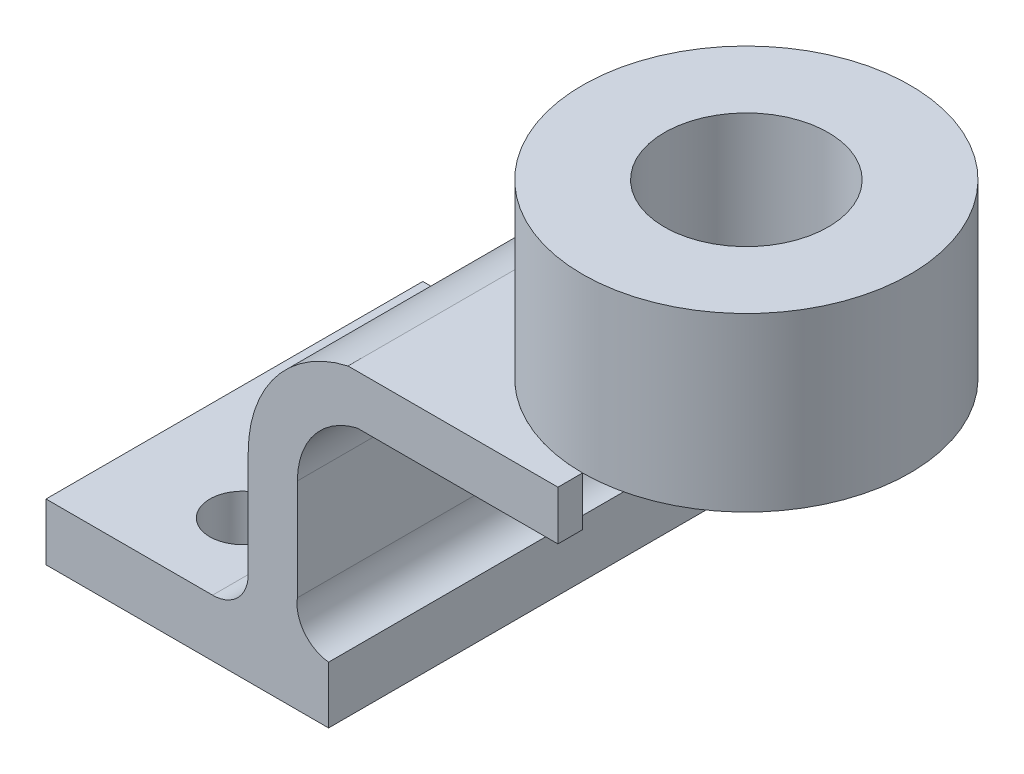
ISO-10303-21;
HEADER;
FILE_DESCRIPTION(('STEP AP214'),'2;1');
FILE_NAME('part.step','',(''),(''),'','','');
FILE_SCHEMA(('AUTOMOTIVE_DESIGN { 1 0 10303 214 1 1 1 1 }'));
ENDSEC;
DATA;
#1=APPLICATION_CONTEXT('core data for automotive mechanical design processes');
#2=APPLICATION_PROTOCOL_DEFINITION('international standard','automotive_design',2000,#1);
#3=PRODUCT_CONTEXT('',#1,'mechanical');
#4=PRODUCT('Part','Part','',(#3));
#5=PRODUCT_RELATED_PRODUCT_CATEGORY('part','',(#4));
#6=PRODUCT_DEFINITION_FORMATION('','',#4);
#7=PRODUCT_DEFINITION_CONTEXT('part definition',#1,'design');
#8=PRODUCT_DEFINITION('design','',#6,#7);
#9=PRODUCT_DEFINITION_SHAPE('','',#8);
#10=(LENGTH_UNIT() NAMED_UNIT(*) SI_UNIT(.MILLI.,.METRE.));
#11=(NAMED_UNIT(*) PLANE_ANGLE_UNIT() SI_UNIT($,.RADIAN.));
#12=(NAMED_UNIT(*) SI_UNIT($,.STERADIAN.) SOLID_ANGLE_UNIT());
#13=UNCERTAINTY_MEASURE_WITH_UNIT(LENGTH_MEASURE(1.E-05),#10,'distance_accuracy_value','');
#14=(GEOMETRIC_REPRESENTATION_CONTEXT(3) GLOBAL_UNCERTAINTY_ASSIGNED_CONTEXT((#13)) GLOBAL_UNIT_ASSIGNED_CONTEXT((#10,
#11,#12)) REPRESENTATION_CONTEXT('',''));
#15=CARTESIAN_POINT('',(0.,0.,0.));
#16=DIRECTION('',(0.,0.,1.));
#17=DIRECTION('',(1.,0.,0.));
#18=AXIS2_PLACEMENT_3D('',#15,#16,#17);
#19=CARTESIAN_POINT('',(-9.49541284403671,53.4425903555686,-46.));
#20=DIRECTION('',(0.,1.,0.));
#21=DIRECTION('',(0.,0.,1.));
#22=AXIS2_PLACEMENT_3D('',#19,#20,#21);
#23=PLANE('',#22);
#24=CARTESIAN_POINT('',(41.7568770301251,53.4425903555686,0.));
#25=DIRECTION('',(0.,1.,0.));
#26=DIRECTION('',(0.,0.,1.));
#27=AXIS2_PLACEMENT_3D('',#24,#25,#26);
#28=CIRCLE('',#27,40.);
#29=CARTESIAN_POINT('',(41.7568770301251,53.4425903555686,40.));
#30=VERTEX_POINT('',#29);
#31=CARTESIAN_POINT('',(41.7568770301251,53.4425903555686,-40.));
#32=VERTEX_POINT('',#31);
#33=EDGE_CURVE('E266',#30,#32,#28,.F.);
#34=ORIENTED_EDGE('',*,*,#33,.T.);
#35=DIRECTION('',(0.,0.,-1.));
#36=VECTOR('',#35,1.);
#37=CARTESIAN_POINT('',(41.7568770301251,53.4425903555686,0.));
#38=LINE('',#37,#36);
#39=CARTESIAN_POINT('',(41.7568770301251,53.4425903555686,-46.));
#40=VERTEX_POINT('',#39);
#41=EDGE_CURVE('E202',#32,#40,#38,.T.);
#42=ORIENTED_EDGE('',*,*,#41,.T.);
#43=DIRECTION('',(-1.,0.,0.));
#44=VECTOR('',#43,1.);
#45=CARTESIAN_POINT('',(-9.49541284403671,53.4425903555686,-46.));
#46=LINE('',#45,#44);
#47=CARTESIAN_POINT('',(-9.49541284403671,53.4425903555686,-46.));
#48=VERTEX_POINT('',#47);
#49=EDGE_CURVE('E199',#40,#48,#46,.T.);
#50=ORIENTED_EDGE('',*,*,#49,.T.);
#51=DIRECTION('',(0.,0.,1.));
#52=VECTOR('',#51,1.);
#53=CARTESIAN_POINT('',(-9.49541284403671,53.4425903555686,-46.));
#54=LINE('',#53,#52);
#55=CARTESIAN_POINT('',(-9.49541284403671,53.4425903555686,46.));
#56=VERTEX_POINT('',#55);
#57=EDGE_CURVE('E201',#48,#56,#54,.T.);
#58=ORIENTED_EDGE('',*,*,#57,.T.);
#59=DIRECTION('',(-1.,0.,0.));
#60=VECTOR('',#59,1.);
#61=CARTESIAN_POINT('',(-9.49541284403671,53.4425903555686,46.));
#62=LINE('',#61,#60);
#63=CARTESIAN_POINT('',(41.7568770301251,53.4425903555686,46.));
#64=VERTEX_POINT('',#63);
#65=EDGE_CURVE('E236',#64,#56,#62,.T.);
#66=ORIENTED_EDGE('',*,*,#65,.F.);
#67=DIRECTION('',(0.,0.,1.));
#68=VECTOR('',#67,1.);
#69=CARTESIAN_POINT('',(41.7568770301251,53.4425903555686,0.));
#70=LINE('',#69,#68);
#71=EDGE_CURVE('E12',#30,#64,#70,.T.);
#72=ORIENTED_EDGE('',*,*,#71,.F.);
#73=EDGE_LOOP('',(#34,#42,#50,#58,#66,#72));
#74=FACE_BOUND('',#73,.T.);
#75=ADVANCED_FACE('F45',(#74),#23,.T.);
#76=CARTESIAN_POINT('',(-7.27806145642214,41.4425656485176,-46.));
#77=DIRECTION('',(0.,-1.,0.));
#78=DIRECTION('',(0.,0.,-1.));
#79=AXIS2_PLACEMENT_3D('',#76,#77,#78);
#80=PLANE('',#79);
#81=DIRECTION('',(1.,0.,0.));
#82=VECTOR('',#81,1.);
#83=CARTESIAN_POINT('',(-7.27806145642214,41.4425656485176,-46.));
#84=LINE('',#83,#82);
#85=CARTESIAN_POINT('',(-7.27806145642214,41.4425656485176,-46.));
#86=VERTEX_POINT('',#85);
#87=CARTESIAN_POINT('',(41.7568770301251,41.4425656485176,-46.));
#88=VERTEX_POINT('',#87);
#89=EDGE_CURVE('E203',#86,#88,#84,.T.);
#90=ORIENTED_EDGE('',*,*,#89,.T.);
#91=DIRECTION('',(0.,0.,1.));
#92=VECTOR('',#91,1.);
#93=CARTESIAN_POINT('',(41.7568770301251,41.4425656485176,-46.));
#94=LINE('',#93,#92);
#95=CARTESIAN_POINT('',(41.7568770301251,41.4425656485176,-40.));
#96=VERTEX_POINT('',#95);
#97=EDGE_CURVE('E206',#88,#96,#94,.T.);
#98=ORIENTED_EDGE('',*,*,#97,.T.);
#99=CARTESIAN_POINT('',(41.7568770301251,41.4425656485176,0.));
#100=DIRECTION('',(0.,-1.,0.));
#101=DIRECTION('',(0.,0.,-1.));
#102=AXIS2_PLACEMENT_3D('',#99,#100,#101);
#103=CIRCLE('',#102,40.);
#104=CARTESIAN_POINT('',(41.7568770301251,41.4425656485176,40.));
#105=VERTEX_POINT('',#104);
#106=EDGE_CURVE('E86',#105,#96,#103,.T.);
#107=ORIENTED_EDGE('',*,*,#106,.F.);
#108=DIRECTION('',(0.,0.,-1.));
#109=VECTOR('',#108,1.);
#110=CARTESIAN_POINT('',(41.7568770301251,41.4425656485176,-46.));
#111=LINE('',#110,#109);
#112=CARTESIAN_POINT('',(41.7568770301251,41.4425656485176,46.));
#113=VERTEX_POINT('',#112);
#114=EDGE_CURVE('E259',#113,#105,#111,.T.);
#115=ORIENTED_EDGE('',*,*,#114,.F.);
#116=DIRECTION('',(1.,0.,0.));
#117=VECTOR('',#116,1.);
#118=CARTESIAN_POINT('',(-7.27806145642214,41.4425656485176,46.));
#119=LINE('',#118,#117);
#120=CARTESIAN_POINT('',(-7.27806145642214,41.4425656485176,46.));
#121=VERTEX_POINT('',#120);
#122=EDGE_CURVE('E223',#121,#113,#119,.T.);
#123=ORIENTED_EDGE('',*,*,#122,.F.);
#124=DIRECTION('',(0.,0.,1.));
#125=VECTOR('',#124,1.);
#126=CARTESIAN_POINT('',(-7.27806145642214,41.4425656485176,-46.));
#127=LINE('',#126,#125);
#128=EDGE_CURVE('E198',#86,#121,#127,.T.);
#129=ORIENTED_EDGE('',*,*,#128,.F.);
#130=EDGE_LOOP('',(#90,#98,#107,#115,#123,#129));
#131=FACE_BOUND('',#130,.T.);
#132=ADVANCED_FACE('F313',(#131),#80,.T.);
#133=CARTESIAN_POINT('',(-42.5733944954129,-2.85101233313381,-46.));
#134=DIRECTION('',(0.,0.,-1.));
#135=DIRECTION('',(-1.,0.,0.));
#136=AXIS2_PLACEMENT_3D('',#133,#134,#135);
#137=PLANE('',#136);
#138=ORIENTED_EDGE('',*,*,#49,.F.);
#139=DIRECTION('',(0.,1.,0.));
#140=VECTOR('',#139,1.);
#141=CARTESIAN_POINT('',(41.7568770301251,4.44259035556865,-46.));
#142=LINE('',#141,#140);
#143=EDGE_CURVE('E77',#88,#40,#142,.T.);
#144=ORIENTED_EDGE('',*,*,#143,.F.);
#145=ORIENTED_EDGE('',*,*,#89,.F.);
#146=CARTESIAN_POINT('',(-2.84865405143777,22.9472477064222,-46.));
#147=DIRECTION('',(0.,0.,-1.));
#148=DIRECTION('',(-1.,0.,0.));
#149=AXIS2_PLACEMENT_3D('',#146,#147,#148);
#150=CIRCLE('',#149,19.0183184256265);
#151=CARTESIAN_POINT('',(-21.8669724770642,22.9472477064222,-46.));
#152=VERTEX_POINT('',#151);
#153=EDGE_CURVE('E207',#152,#86,#150,.T.);
#154=ORIENTED_EDGE('',*,*,#153,.F.);
#155=DIRECTION('',(0.,1.,0.));
#156=VECTOR('',#155,1.);
#157=CARTESIAN_POINT('',(-21.8669724770642,-1.75425159718645,-46.));
#158=LINE('',#157,#156);
#159=CARTESIAN_POINT('',(-21.8669724770642,-1.75425159718645,-46.));
#160=VERTEX_POINT('',#159);
#161=EDGE_CURVE('E211',#160,#152,#158,.T.);
#162=ORIENTED_EDGE('',*,*,#161,.F.);
#163=CARTESIAN_POINT('',(-13.3869449851293,-3.02550029347313,-46.));
#164=DIRECTION('',(0.,0.,-1.));
#165=DIRECTION('',(-1.,0.,0.));
#166=AXIS2_PLACEMENT_3D('',#163,#164,#165);
#167=CIRCLE('',#166,8.574785100035);
#168=CARTESIAN_POINT('',(-14.2431229698749,-11.5574343514824,-46.));
#169=VERTEX_POINT('',#168);
#170=EDGE_CURVE('E215',#169,#160,#167,.T.);
#171=ORIENTED_EDGE('',*,*,#170,.F.);
#172=DIRECTION('',(0.,1.,0.));
#173=VECTOR('',#172,1.);
#174=CARTESIAN_POINT('',(-14.2431229698749,-25.4793825052162,-46.));
#175=LINE('',#174,#173);
#176=CARTESIAN_POINT('',(-14.2431229698749,-25.4793825052162,-46.));
#177=VERTEX_POINT('',#176);
#178=EDGE_CURVE('E219',#177,#169,#175,.T.);
#179=ORIENTED_EDGE('',*,*,#178,.F.);
#180=DIRECTION('',(1.,0.,0.));
#181=VECTOR('',#180,1.);
#182=CARTESIAN_POINT('',(-83.2431229698749,-25.4793825052162,-46.));
#183=LINE('',#182,#181);
#184=CARTESIAN_POINT('',(-83.2431229698749,-25.4793825052162,-46.));
#185=VERTEX_POINT('',#184);
#186=EDGE_CURVE('E179',#185,#177,#183,.T.);
#187=ORIENTED_EDGE('',*,*,#186,.F.);
#188=DIRECTION('',(0.,-1.,0.));
#189=VECTOR('',#188,1.);
#190=CARTESIAN_POINT('',(-83.2431229698749,-25.4793825052162,-46.));
#191=LINE('',#190,#189);
#192=CARTESIAN_POINT('',(-83.2431229698749,-11.5574343514824,-46.));
#193=VERTEX_POINT('',#192);
#194=EDGE_CURVE('E162',#193,#185,#191,.T.);
#195=ORIENTED_EDGE('',*,*,#194,.F.);
#196=DIRECTION('',(-1.,0.,0.));
#197=VECTOR('',#196,1.);
#198=CARTESIAN_POINT('',(-83.2431229698749,-11.5574343514824,-46.));
#199=LINE('',#198,#197);
#200=CARTESIAN_POINT('',(-42.5733944954129,-11.5574343514824,-46.));
#201=VERTEX_POINT('',#200);
#202=EDGE_CURVE('E169',#201,#193,#199,.T.);
#203=ORIENTED_EDGE('',*,*,#202,.F.);
#204=CARTESIAN_POINT('',(-42.5733944954129,-2.85101233313381,-46.));
#205=DIRECTION('',(0.,0.,-1.));
#206=DIRECTION('',(-1.,0.,0.));
#207=AXIS2_PLACEMENT_3D('',#204,#205,#206);
#208=CIRCLE('',#207,8.70642201834863);
#209=CARTESIAN_POINT('',(-33.8669724770642,-2.85101233313381,-46.));
#210=VERTEX_POINT('',#209);
#211=EDGE_CURVE('E186',#210,#201,#208,.T.);
#212=ORIENTED_EDGE('',*,*,#211,.F.);
#213=DIRECTION('',(0.,-1.,0.));
#214=VECTOR('',#213,1.);
#215=CARTESIAN_POINT('',(-33.8669724770642,-2.85101233313381,-46.));
#216=LINE('',#215,#214);
#217=CARTESIAN_POINT('',(-33.8669724770642,22.947247706422,-46.));
#218=VERTEX_POINT('',#217);
#219=EDGE_CURVE('E191',#218,#210,#216,.T.);
#220=ORIENTED_EDGE('',*,*,#219,.F.);
#221=CARTESIAN_POINT('',(-2.60227573254637,22.947247706422,-46.));
#222=DIRECTION('',(0.,0.,1.));
#223=DIRECTION('',(-1.,0.,0.));
#224=AXIS2_PLACEMENT_3D('',#221,#222,#223);
#225=CIRCLE('',#224,31.2646967445179);
#226=EDGE_CURVE('E195',#48,#218,#225,.T.);
#227=ORIENTED_EDGE('',*,*,#226,.F.);
#228=EDGE_LOOP('',(#138,#144,#145,#154,#162,#171,#179,#187,#195,#203,#212,#220,#227));
#229=FACE_BOUND('',#228,.T.);
#230=ADVANCED_FACE('F175',(#229),#137,.T.);
#231=CARTESIAN_POINT('',(-83.2431229698749,-25.4793825052162,-46.));
#232=DIRECTION('',(-1.,0.,0.));
#233=DIRECTION('',(0.,0.,1.));
#234=AXIS2_PLACEMENT_3D('',#231,#232,#233);
#235=PLANE('',#234);
#236=DIRECTION('',(0.,0.,1.));
#237=VECTOR('',#236,1.);
#238=CARTESIAN_POINT('',(-83.2431229698749,-25.4793825052162,-46.));
#239=LINE('',#238,#237);
#240=CARTESIAN_POINT('',(-83.2431229698749,-25.4793825052162,46.));
#241=VERTEX_POINT('',#240);
#242=EDGE_CURVE('E180',#185,#241,#239,.T.);
#243=ORIENTED_EDGE('',*,*,#242,.T.);
#244=DIRECTION('',(0.,-1.,0.));
#245=VECTOR('',#244,1.);
#246=CARTESIAN_POINT('',(-83.2431229698749,-25.4793825052162,46.));
#247=LINE('',#246,#245);
#248=CARTESIAN_POINT('',(-83.2431229698749,-11.5574343514824,46.));
#249=VERTEX_POINT('',#248);
#250=EDGE_CURVE('E164',#249,#241,#247,.T.);
#251=ORIENTED_EDGE('',*,*,#250,.F.);
#252=DIRECTION('',(0.,0.,1.));
#253=VECTOR('',#252,1.);
#254=CARTESIAN_POINT('',(-83.2431229698749,-11.5574343514824,-46.));
#255=LINE('',#254,#253);
#256=EDGE_CURVE('E159',#193,#249,#255,.T.);
#257=ORIENTED_EDGE('',*,*,#256,.F.);
#258=ORIENTED_EDGE('',*,*,#194,.T.);
#259=EDGE_LOOP('',(#243,#251,#257,#258));
#260=FACE_BOUND('',#259,.T.);
#261=ADVANCED_FACE('F161',(#260),#235,.T.);
#262=CARTESIAN_POINT('',(-83.2431229698749,-11.5574343514824,-46.));
#263=DIRECTION('',(0.,1.,0.));
#264=DIRECTION('',(0.,0.,1.));
#265=AXIS2_PLACEMENT_3D('',#262,#263,#264);
#266=PLANE('',#265);
#267=CARTESIAN_POINT('',(-55.243122969875,-11.5574343514824,26.));
#268=DIRECTION('',(0.,1.,0.));
#269=DIRECTION('',(0.,0.,1.));
#270=AXIS2_PLACEMENT_3D('',#267,#268,#269);
#271=CIRCLE('',#270,8.);
#272=CARTESIAN_POINT('',(-55.243122969875,-11.5574343514824,34.));
#273=VERTEX_POINT('',#272);
#274=EDGE_CURVE('E271',#273,#273,#271,.T.);
#275=ORIENTED_EDGE('',*,*,#274,.F.);
#276=EDGE_LOOP('',(#275));
#277=FACE_BOUND('',#276,.T.);
#278=CARTESIAN_POINT('',(-55.243122969875,-11.5574343514824,-26.));
#279=DIRECTION('',(0.,1.,0.));
#280=DIRECTION('',(0.,0.,1.));
#281=AXIS2_PLACEMENT_3D('',#278,#279,#280);
#282=CIRCLE('',#281,8.);
#283=CARTESIAN_POINT('',(-55.243122969875,-11.5574343514824,-18.));
#284=VERTEX_POINT('',#283);
#285=EDGE_CURVE('E276',#284,#284,#282,.T.);
#286=ORIENTED_EDGE('',*,*,#285,.F.);
#287=EDGE_LOOP('',(#286));
#288=FACE_BOUND('',#287,.T.);
#289=ORIENTED_EDGE('',*,*,#256,.T.);
#290=DIRECTION('',(-1.,0.,0.));
#291=VECTOR('',#290,1.);
#292=CARTESIAN_POINT('',(-83.2431229698749,-11.5574343514824,46.));
#293=LINE('',#292,#291);
#294=CARTESIAN_POINT('',(-42.5733944954129,-11.5574343514824,46.));
#295=VERTEX_POINT('',#294);
#296=EDGE_CURVE('E225',#295,#249,#293,.T.);
#297=ORIENTED_EDGE('',*,*,#296,.F.);
#298=DIRECTION('',(0.,0.,1.));
#299=VECTOR('',#298,1.);
#300=CARTESIAN_POINT('',(-42.5733944954129,-11.5574343514824,-46.));
#301=LINE('',#300,#299);
#302=EDGE_CURVE('E183',#201,#295,#301,.T.);
#303=ORIENTED_EDGE('',*,*,#302,.F.);
#304=ORIENTED_EDGE('',*,*,#202,.T.);
#305=EDGE_LOOP('',(#289,#297,#303,#304));
#306=FACE_BOUND('',#305,.T.);
#307=ADVANCED_FACE('F182',(#277,#288,#306),#266,.T.);
#308=CARTESIAN_POINT('',(-42.5733944954129,-2.85101233313381,-46.));
#309=DIRECTION('',(0.,0.,1.));
#310=DIRECTION('',(1.,0.,0.));
#311=AXIS2_PLACEMENT_3D('',#308,#309,#310);
#312=CYLINDRICAL_SURFACE('',#311,8.70642201834863);
#313=ORIENTED_EDGE('',*,*,#302,.T.);
#314=CARTESIAN_POINT('',(-42.5733944954129,-2.85101233313381,46.));
#315=DIRECTION('',(0.,0.,-1.));
#316=DIRECTION('',(-1.,0.,0.));
#317=AXIS2_PLACEMENT_3D('',#314,#315,#316);
#318=CIRCLE('',#317,8.70642201834863);
#319=CARTESIAN_POINT('',(-33.8669724770642,-2.85101233313381,46.));
#320=VERTEX_POINT('',#319);
#321=EDGE_CURVE('E227',#320,#295,#318,.T.);
#322=ORIENTED_EDGE('',*,*,#321,.F.);
#323=DIRECTION('',(0.,0.,1.));
#324=VECTOR('',#323,1.);
#325=CARTESIAN_POINT('',(-33.8669724770642,-2.85101233313381,-46.));
#326=LINE('',#325,#324);
#327=EDGE_CURVE('E190',#210,#320,#326,.T.);
#328=ORIENTED_EDGE('',*,*,#327,.F.);
#329=ORIENTED_EDGE('',*,*,#211,.T.);
#330=EDGE_LOOP('',(#313,#322,#328,#329));
#331=FACE_BOUND('',#330,.T.);
#332=ADVANCED_FACE('F302',(#331),#312,.F.);
#333=CARTESIAN_POINT('',(-33.8669724770642,-2.85101233313381,-46.));
#334=DIRECTION('',(-1.,0.,0.));
#335=DIRECTION('',(0.,0.,1.));
#336=AXIS2_PLACEMENT_3D('',#333,#334,#335);
#337=PLANE('',#336);
#338=ORIENTED_EDGE('',*,*,#327,.T.);
#339=DIRECTION('',(0.,-1.,0.));
#340=VECTOR('',#339,1.);
#341=CARTESIAN_POINT('',(-33.8669724770642,-2.85101233313381,46.));
#342=LINE('',#341,#340);
#343=CARTESIAN_POINT('',(-33.8669724770642,22.947247706422,46.));
#344=VERTEX_POINT('',#343);
#345=EDGE_CURVE('E230',#344,#320,#342,.T.);
#346=ORIENTED_EDGE('',*,*,#345,.F.);
#347=DIRECTION('',(0.,0.,1.));
#348=VECTOR('',#347,1.);
#349=CARTESIAN_POINT('',(-33.8669724770642,22.947247706422,-46.));
#350=LINE('',#349,#348);
#351=EDGE_CURVE('E194',#218,#344,#350,.T.);
#352=ORIENTED_EDGE('',*,*,#351,.F.);
#353=ORIENTED_EDGE('',*,*,#219,.T.);
#354=EDGE_LOOP('',(#338,#346,#352,#353));
#355=FACE_BOUND('',#354,.T.);
#356=ADVANCED_FACE('F295',(#355),#337,.T.);
#357=CARTESIAN_POINT('',(-2.60227573254637,22.947247706422,-46.));
#358=DIRECTION('',(0.,0.,1.));
#359=DIRECTION('',(1.,0.,0.));
#360=AXIS2_PLACEMENT_3D('',#357,#358,#359);
#361=CYLINDRICAL_SURFACE('',#360,31.2646967445179);
#362=ORIENTED_EDGE('',*,*,#351,.T.);
#363=CARTESIAN_POINT('',(-2.60227573254637,22.947247706422,46.));
#364=DIRECTION('',(0.,0.,1.));
#365=DIRECTION('',(-1.,0.,0.));
#366=AXIS2_PLACEMENT_3D('',#363,#364,#365);
#367=CIRCLE('',#366,31.2646967445179);
#368=EDGE_CURVE('E233',#56,#344,#367,.T.);
#369=ORIENTED_EDGE('',*,*,#368,.F.);
#370=ORIENTED_EDGE('',*,*,#57,.F.);
#371=ORIENTED_EDGE('',*,*,#226,.T.);
#372=EDGE_LOOP('',(#362,#369,#370,#371));
#373=FACE_BOUND('',#372,.T.);
#374=ADVANCED_FACE('F306',(#373),#361,.T.);
#375=CARTESIAN_POINT('',(-2.84865405143777,22.9472477064222,-46.));
#376=DIRECTION('',(0.,0.,1.));
#377=DIRECTION('',(1.,0.,0.));
#378=AXIS2_PLACEMENT_3D('',#375,#376,#377);
#379=CYLINDRICAL_SURFACE('',#378,19.0183184256265);
#380=ORIENTED_EDGE('',*,*,#128,.T.);
#381=CARTESIAN_POINT('',(-2.84865405143777,22.9472477064222,46.));
#382=DIRECTION('',(0.,0.,-1.));
#383=DIRECTION('',(-1.,0.,0.));
#384=AXIS2_PLACEMENT_3D('',#381,#382,#383);
#385=CIRCLE('',#384,19.0183184256265);
#386=CARTESIAN_POINT('',(-21.8669724770642,22.9472477064222,46.));
#387=VERTEX_POINT('',#386);
#388=EDGE_CURVE('E240',#387,#121,#385,.T.);
#389=ORIENTED_EDGE('',*,*,#388,.F.);
#390=DIRECTION('',(0.,0.,1.));
#391=VECTOR('',#390,1.);
#392=CARTESIAN_POINT('',(-21.8669724770642,22.9472477064222,-46.));
#393=LINE('',#392,#391);
#394=EDGE_CURVE('E210',#152,#387,#393,.T.);
#395=ORIENTED_EDGE('',*,*,#394,.F.);
#396=ORIENTED_EDGE('',*,*,#153,.T.);
#397=EDGE_LOOP('',(#380,#389,#395,#396));
#398=FACE_BOUND('',#397,.T.);
#399=ADVANCED_FACE('F317',(#398),#379,.F.);
#400=CARTESIAN_POINT('',(-21.8669724770642,-1.75425159718645,-46.));
#401=DIRECTION('',(1.,0.,0.));
#402=DIRECTION('',(0.,0.,-1.));
#403=AXIS2_PLACEMENT_3D('',#400,#401,#402);
#404=PLANE('',#403);
#405=ORIENTED_EDGE('',*,*,#394,.T.);
#406=DIRECTION('',(0.,1.,0.));
#407=VECTOR('',#406,1.);
#408=CARTESIAN_POINT('',(-21.8669724770642,-1.75425159718645,46.));
#409=LINE('',#408,#407);
#410=CARTESIAN_POINT('',(-21.8669724770642,-1.75425159718645,46.));
#411=VERTEX_POINT('',#410);
#412=EDGE_CURVE('E244',#411,#387,#409,.T.);
#413=ORIENTED_EDGE('',*,*,#412,.F.);
#414=DIRECTION('',(0.,0.,1.));
#415=VECTOR('',#414,1.);
#416=CARTESIAN_POINT('',(-21.8669724770642,-1.75425159718645,-46.));
#417=LINE('',#416,#415);
#418=EDGE_CURVE('E214',#160,#411,#417,.T.);
#419=ORIENTED_EDGE('',*,*,#418,.F.);
#420=ORIENTED_EDGE('',*,*,#161,.T.);
#421=EDGE_LOOP('',(#405,#413,#419,#420));
#422=FACE_BOUND('',#421,.T.);
#423=ADVANCED_FACE('F321',(#422),#404,.T.);
#424=CARTESIAN_POINT('',(-13.3869449851293,-3.02550029347313,-46.));
#425=DIRECTION('',(0.,0.,1.));
#426=DIRECTION('',(1.,0.,0.));
#427=AXIS2_PLACEMENT_3D('',#424,#425,#426);
#428=CYLINDRICAL_SURFACE('',#427,8.574785100035);
#429=ORIENTED_EDGE('',*,*,#418,.T.);
#430=CARTESIAN_POINT('',(-13.3869449851293,-3.02550029347313,46.));
#431=DIRECTION('',(0.,0.,-1.));
#432=DIRECTION('',(-1.,0.,0.));
#433=AXIS2_PLACEMENT_3D('',#430,#431,#432);
#434=CIRCLE('',#433,8.574785100035);
#435=CARTESIAN_POINT('',(-14.2431229698749,-11.5574343514824,46.));
#436=VERTEX_POINT('',#435);
#437=EDGE_CURVE('E247',#436,#411,#434,.T.);
#438=ORIENTED_EDGE('',*,*,#437,.F.);
#439=DIRECTION('',(0.,0.,1.));
#440=VECTOR('',#439,1.);
#441=CARTESIAN_POINT('',(-14.2431229698749,-11.5574343514824,-46.));
#442=LINE('',#441,#440);
#443=EDGE_CURVE('E218',#169,#436,#442,.T.);
#444=ORIENTED_EDGE('',*,*,#443,.F.);
#445=ORIENTED_EDGE('',*,*,#170,.T.);
#446=EDGE_LOOP('',(#429,#438,#444,#445));
#447=FACE_BOUND('',#446,.T.);
#448=ADVANCED_FACE('F325',(#447),#428,.F.);
#449=CARTESIAN_POINT('',(-14.2431229698749,-25.4793825052162,-46.));
#450=DIRECTION('',(1.,0.,0.));
#451=DIRECTION('',(0.,1.,0.));
#452=AXIS2_PLACEMENT_3D('',#449,#450,#451);
#453=PLANE('',#452);
#454=ORIENTED_EDGE('',*,*,#443,.T.);
#455=DIRECTION('',(0.,1.,0.));
#456=VECTOR('',#455,1.);
#457=CARTESIAN_POINT('',(-14.2431229698749,-25.4793825052162,46.));
#458=LINE('',#457,#456);
#459=CARTESIAN_POINT('',(-14.2431229698749,-25.4793825052162,46.));
#460=VERTEX_POINT('',#459);
#461=EDGE_CURVE('E250',#460,#436,#458,.T.);
#462=ORIENTED_EDGE('',*,*,#461,.F.);
#463=DIRECTION('',(0.,0.,1.));
#464=VECTOR('',#463,1.);
#465=CARTESIAN_POINT('',(-14.2431229698749,-25.4793825052162,-46.));
#466=LINE('',#465,#464);
#467=EDGE_CURVE('E222',#177,#460,#466,.T.);
#468=ORIENTED_EDGE('',*,*,#467,.F.);
#469=ORIENTED_EDGE('',*,*,#178,.T.);
#470=EDGE_LOOP('',(#454,#462,#468,#469));
#471=FACE_BOUND('',#470,.T.);
#472=ADVANCED_FACE('F328',(#471),#453,.T.);
#473=CARTESIAN_POINT('',(-83.2431229698749,-25.4793825052162,-46.));
#474=DIRECTION('',(0.,-1.,0.));
#475=DIRECTION('',(0.,0.,-1.));
#476=AXIS2_PLACEMENT_3D('',#473,#474,#475);
#477=PLANE('',#476);
#478=CARTESIAN_POINT('',(-55.243122969875,-25.4793825052162,26.));
#479=DIRECTION('',(0.,-1.,0.));
#480=DIRECTION('',(0.,0.,-1.));
#481=AXIS2_PLACEMENT_3D('',#478,#479,#480);
#482=CIRCLE('',#481,8.);
#483=CARTESIAN_POINT('',(-55.243122969875,-25.4793825052162,18.));
#484=VERTEX_POINT('',#483);
#485=EDGE_CURVE('E49',#484,#484,#482,.T.);
#486=ORIENTED_EDGE('',*,*,#485,.F.);
#487=EDGE_LOOP('',(#486));
#488=FACE_BOUND('',#487,.T.);
#489=CARTESIAN_POINT('',(-55.243122969875,-25.4793825052162,-26.));
#490=DIRECTION('',(0.,-1.,0.));
#491=DIRECTION('',(0.,0.,-1.));
#492=AXIS2_PLACEMENT_3D('',#489,#490,#491);
#493=CIRCLE('',#492,8.);
#494=CARTESIAN_POINT('',(-55.243122969875,-25.4793825052162,-34.));
#495=VERTEX_POINT('',#494);
#496=EDGE_CURVE('E269',#495,#495,#493,.T.);
#497=ORIENTED_EDGE('',*,*,#496,.F.);
#498=EDGE_LOOP('',(#497));
#499=FACE_BOUND('',#498,.T.);
#500=ORIENTED_EDGE('',*,*,#467,.T.);
#501=DIRECTION('',(1.,0.,0.));
#502=VECTOR('',#501,1.);
#503=CARTESIAN_POINT('',(-83.2431229698749,-25.4793825052162,46.));
#504=LINE('',#503,#502);
#505=EDGE_CURVE('E253',#241,#460,#504,.T.);
#506=ORIENTED_EDGE('',*,*,#505,.F.);
#507=ORIENTED_EDGE('',*,*,#242,.F.);
#508=ORIENTED_EDGE('',*,*,#186,.T.);
#509=EDGE_LOOP('',(#500,#506,#507,#508));
#510=FACE_BOUND('',#509,.T.);
#511=ADVANCED_FACE('F331',(#488,#499,#510),#477,.T.);
#512=CARTESIAN_POINT('',(-42.5733944954129,-2.85101233313381,46.));
#513=DIRECTION('',(0.,0.,-1.));
#514=DIRECTION('',(-1.,0.,0.));
#515=AXIS2_PLACEMENT_3D('',#512,#513,#514);
#516=PLANE('',#515);
#517=ORIENTED_EDGE('',*,*,#122,.T.);
#518=DIRECTION('',(0.,1.,0.));
#519=VECTOR('',#518,1.);
#520=CARTESIAN_POINT('',(41.7568770301251,4.44259035556865,46.));
#521=LINE('',#520,#519);
#522=EDGE_CURVE('E62',#113,#64,#521,.T.);
#523=ORIENTED_EDGE('',*,*,#522,.T.);
#524=ORIENTED_EDGE('',*,*,#65,.T.);
#525=ORIENTED_EDGE('',*,*,#368,.T.);
#526=ORIENTED_EDGE('',*,*,#345,.T.);
#527=ORIENTED_EDGE('',*,*,#321,.T.);
#528=ORIENTED_EDGE('',*,*,#296,.T.);
#529=ORIENTED_EDGE('',*,*,#250,.T.);
#530=ORIENTED_EDGE('',*,*,#505,.T.);
#531=ORIENTED_EDGE('',*,*,#461,.T.);
#532=ORIENTED_EDGE('',*,*,#437,.T.);
#533=ORIENTED_EDGE('',*,*,#412,.T.);
#534=ORIENTED_EDGE('',*,*,#388,.T.);
#535=EDGE_LOOP('',(#517,#523,#524,#525,#526,#527,#528,#529,#530,#531,#532,#533,#534));
#536=FACE_BOUND('',#535,.T.);
#537=ADVANCED_FACE('F300',(#536),#516,.F.);
#538=CARTESIAN_POINT('',(41.7568770301251,4.44259035556865,0.));
#539=DIRECTION('',(0.,1.,0.));
#540=DIRECTION('',(0.,0.,1.));
#541=AXIS2_PLACEMENT_3D('',#538,#539,#540);
#542=CYLINDRICAL_SURFACE('',#541,40.);
#543=DIRECTION('',(0.,1.,0.));
#544=VECTOR('',#543,1.);
#545=CARTESIAN_POINT('',(41.7568770301251,4.44259035556865,-40.));
#546=LINE('',#545,#544);
#547=EDGE_CURVE('E243',#96,#32,#546,.T.);
#548=ORIENTED_EDGE('',*,*,#547,.T.);
#549=ORIENTED_EDGE('',*,*,#33,.F.);
#550=DIRECTION('',(0.,1.,0.));
#551=VECTOR('',#550,1.);
#552=CARTESIAN_POINT('',(41.7568770301251,4.44259035556865,40.));
#553=LINE('',#552,#551);
#554=EDGE_CURVE('E55',#105,#30,#553,.T.);
#555=ORIENTED_EDGE('',*,*,#554,.F.);
#556=ORIENTED_EDGE('',*,*,#106,.T.);
#557=EDGE_LOOP('',(#548,#549,#555,#556));
#558=FACE_BOUND('',#557,.T.);
#559=ADVANCED_FACE('F339',(#558),#542,.F.);
#560=CARTESIAN_POINT('',(41.7568770301251,4.44259035556865,0.));
#561=DIRECTION('',(1.,0.,0.));
#562=DIRECTION('',(0.,0.,-1.));
#563=AXIS2_PLACEMENT_3D('',#560,#561,#562);
#564=PLANE('',#563);
#565=ORIENTED_EDGE('',*,*,#143,.T.);
#566=ORIENTED_EDGE('',*,*,#41,.F.);
#567=ORIENTED_EDGE('',*,*,#547,.F.);
#568=ORIENTED_EDGE('',*,*,#97,.F.);
#569=EDGE_LOOP('',(#565,#566,#567,#568));
#570=FACE_BOUND('',#569,.T.);
#571=ADVANCED_FACE('F364',(#570),#564,.T.);
#572=CARTESIAN_POINT('',(41.7568770301251,4.44259035556865,0.));
#573=DIRECTION('',(-1.,0.,0.));
#574=DIRECTION('',(0.,0.,1.));
#575=AXIS2_PLACEMENT_3D('',#572,#573,#574);
#576=PLANE('',#575);
#577=ORIENTED_EDGE('',*,*,#114,.T.);
#578=ORIENTED_EDGE('',*,*,#554,.T.);
#579=ORIENTED_EDGE('',*,*,#71,.T.);
#580=ORIENTED_EDGE('',*,*,#522,.F.);
#581=EDGE_LOOP('',(#577,#578,#579,#580));
#582=FACE_BOUND('',#581,.T.);
#583=ADVANCED_FACE('F47',(#582),#576,.F.);
#584=CARTESIAN_POINT('',(-55.243122969875,-60.5574343514824,-26.));
#585=DIRECTION('',(0.,1.,0.));
#586=DIRECTION('',(0.,0.,1.));
#587=AXIS2_PLACEMENT_3D('',#584,#585,#586);
#588=CYLINDRICAL_SURFACE('',#587,8.);
#589=ORIENTED_EDGE('',*,*,#496,.T.);
#590=EDGE_LOOP('',(#589));
#591=FACE_BOUND('',#590,.T.);
#592=ORIENTED_EDGE('',*,*,#285,.T.);
#593=EDGE_LOOP('',(#592));
#594=FACE_BOUND('',#593,.T.);
#595=ADVANCED_FACE('F370',(#591,#594),#588,.F.);
#596=CARTESIAN_POINT('',(-55.243122969875,-60.5574343514824,26.));
#597=DIRECTION('',(0.,1.,0.));
#598=DIRECTION('',(0.,0.,1.));
#599=AXIS2_PLACEMENT_3D('',#596,#597,#598);
#600=CYLINDRICAL_SURFACE('',#599,8.);
#601=ORIENTED_EDGE('',*,*,#485,.T.);
#602=EDGE_LOOP('',(#601));
#603=FACE_BOUND('',#602,.T.);
#604=ORIENTED_EDGE('',*,*,#274,.T.);
#605=EDGE_LOOP('',(#604));
#606=FACE_BOUND('',#605,.T.);
#607=ADVANCED_FACE('F374',(#603,#606),#600,.F.);
#608=CLOSED_SHELL('',(#75,#132,#230,#261,#307,#332,#356,#374,#399,#423,#448,#472,#511,#537,#559,
#571,#583,#595,#607));
#609=MANIFOLD_SOLID_BREP('B2',#608);
#610=CARTESIAN_POINT('',(41.7568770301251,35.4425903555687,0.));
#611=DIRECTION('',(0.,1.,0.));
#612=DIRECTION('',(0.,0.,1.));
#613=AXIS2_PLACEMENT_3D('',#610,#611,#612);
#614=CYLINDRICAL_SURFACE('',#613,20.);
#615=CARTESIAN_POINT('',(41.7568770301251,53.4425903555686,0.));
#616=DIRECTION('',(0.,1.,0.));
#617=DIRECTION('',(0.,0.,1.));
#618=AXIS2_PLACEMENT_3D('',#615,#616,#617);
#619=CIRCLE('',#618,20.);
#620=CARTESIAN_POINT('',(41.7568770301251,53.4425903555686,20.));
#621=VERTEX_POINT('',#620);
#622=EDGE_CURVE('E500',#621,#621,#619,.T.);
#623=ORIENTED_EDGE('',*,*,#622,.F.);
#624=EDGE_LOOP('',(#623));
#625=FACE_BOUND('',#624,.T.);
#626=CARTESIAN_POINT('',(41.7568770301251,95.4425903555687,0.));
#627=DIRECTION('',(0.,1.,0.));
#628=DIRECTION('',(0.,0.,1.));
#629=AXIS2_PLACEMENT_3D('',#626,#627,#628);
#630=CIRCLE('',#629,20.);
#631=CARTESIAN_POINT('',(41.7568770301251,95.4425903555687,20.));
#632=VERTEX_POINT('',#631);
#633=EDGE_CURVE('E508',#632,#632,#630,.T.);
#634=ORIENTED_EDGE('',*,*,#633,.T.);
#635=EDGE_LOOP('',(#634));
#636=FACE_BOUND('',#635,.T.);
#637=ADVANCED_FACE('F497',(#625,#636),#614,.F.);
#638=CARTESIAN_POINT('',(0.,95.4425903555687,0.));
#639=DIRECTION('',(0.,1.,0.));
#640=DIRECTION('',(0.,0.,1.));
#641=AXIS2_PLACEMENT_3D('',#638,#639,#640);
#642=PLANE('',#641);
#643=ORIENTED_EDGE('',*,*,#633,.F.);
#644=EDGE_LOOP('',(#643));
#645=FACE_BOUND('',#644,.T.);
#646=CARTESIAN_POINT('',(41.7568770301251,95.4425903555687,0.));
#647=DIRECTION('',(0.,1.,0.));
#648=DIRECTION('',(0.,0.,1.));
#649=AXIS2_PLACEMENT_3D('',#646,#647,#648);
#650=CIRCLE('',#649,40.);
#651=CARTESIAN_POINT('',(41.7568770301251,95.4425903555687,40.));
#652=VERTEX_POINT('',#651);
#653=EDGE_CURVE('E504',#652,#652,#650,.T.);
#654=ORIENTED_EDGE('',*,*,#653,.T.);
#655=EDGE_LOOP('',(#654));
#656=FACE_BOUND('',#655,.T.);
#657=ADVANCED_FACE('F521',(#645,#656),#642,.T.);
#658=CARTESIAN_POINT('',(41.7568770301251,35.4425903555687,0.));
#659=DIRECTION('',(0.,1.,0.));
#660=DIRECTION('',(0.,0.,1.));
#661=AXIS2_PLACEMENT_3D('',#658,#659,#660);
#662=CYLINDRICAL_SURFACE('',#661,40.);
#663=CARTESIAN_POINT('',(41.7568770301251,53.4425903555686,0.));
#664=DIRECTION('',(0.,1.,0.));
#665=DIRECTION('',(0.,0.,1.));
#666=AXIS2_PLACEMENT_3D('',#663,#664,#665);
#667=CIRCLE('',#666,40.);
#668=CARTESIAN_POINT('',(41.7568770301251,53.4425903555686,40.));
#669=VERTEX_POINT('',#668);
#670=EDGE_CURVE('E44',#669,#669,#667,.T.);
#671=ORIENTED_EDGE('',*,*,#670,.T.);
#672=EDGE_LOOP('',(#671));
#673=FACE_BOUND('',#672,.T.);
#674=ORIENTED_EDGE('',*,*,#653,.F.);
#675=EDGE_LOOP('',(#674));
#676=FACE_BOUND('',#675,.T.);
#677=ADVANCED_FACE('F525',(#673,#676),#662,.T.);
#678=CARTESIAN_POINT('',(0.,53.4425903555686,0.));
#679=DIRECTION('',(0.,1.,0.));
#680=DIRECTION('',(0.,0.,1.));
#681=AXIS2_PLACEMENT_3D('',#678,#679,#680);
#682=PLANE('',#681);
#683=ORIENTED_EDGE('',*,*,#622,.T.);
#684=EDGE_LOOP('',(#683));
#685=FACE_BOUND('',#684,.T.);
#686=ORIENTED_EDGE('',*,*,#670,.F.);
#687=EDGE_LOOP('',(#686));
#688=FACE_BOUND('',#687,.T.);
#689=ADVANCED_FACE('F517',(#685,#688),#682,.F.);
#690=CLOSED_SHELL('',(#637,#657,#677,#689));
#691=MANIFOLD_SOLID_BREP('B6',#690);
#692=ADVANCED_BREP_SHAPE_REPRESENTATION('',(#18,#609,#691),#14);
#693=SHAPE_DEFINITION_REPRESENTATION(#9,#692);
ENDSEC;
END-ISO-10303-21;
